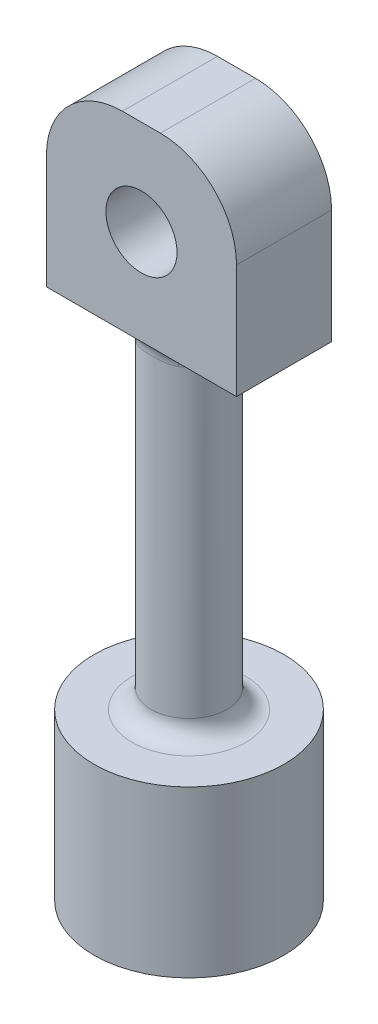
ISO-10303-21;
HEADER;
FILE_DESCRIPTION(('STEP AP214'),'2;1');
FILE_NAME('part.step','',(''),(''),'','','');
FILE_SCHEMA(('AUTOMOTIVE_DESIGN { 1 0 10303 214 1 1 1 1 }'));
ENDSEC;
DATA;
#1=APPLICATION_CONTEXT('core data for automotive mechanical design processes');
#2=APPLICATION_PROTOCOL_DEFINITION('international standard','automotive_design',2000,#1);
#3=PRODUCT_CONTEXT('',#1,'mechanical');
#4=PRODUCT('Part','Part','',(#3));
#5=PRODUCT_RELATED_PRODUCT_CATEGORY('part','',(#4));
#6=PRODUCT_DEFINITION_FORMATION('','',#4);
#7=PRODUCT_DEFINITION_CONTEXT('part definition',#1,'design');
#8=PRODUCT_DEFINITION('design','',#6,#7);
#9=PRODUCT_DEFINITION_SHAPE('','',#8);
#10=(LENGTH_UNIT() NAMED_UNIT(*) SI_UNIT(.MILLI.,.METRE.));
#11=(NAMED_UNIT(*) PLANE_ANGLE_UNIT() SI_UNIT($,.RADIAN.));
#12=(NAMED_UNIT(*) SI_UNIT($,.STERADIAN.) SOLID_ANGLE_UNIT());
#13=UNCERTAINTY_MEASURE_WITH_UNIT(LENGTH_MEASURE(1.E-05),#10,'distance_accuracy_value','');
#14=(GEOMETRIC_REPRESENTATION_CONTEXT(3) GLOBAL_UNCERTAINTY_ASSIGNED_CONTEXT((#13)) GLOBAL_UNIT_ASSIGNED_CONTEXT((#10,
#11,#12)) REPRESENTATION_CONTEXT('',''));
#15=CARTESIAN_POINT('',(0.,0.,0.));
#16=DIRECTION('',(0.,0.,1.));
#17=DIRECTION('',(1.,0.,0.));
#18=AXIS2_PLACEMENT_3D('',#15,#16,#17);
#19=CARTESIAN_POINT('',(-6.35000000000034,37.1852685018555,3.175));
#20=DIRECTION('',(0.,1.,0.));
#21=DIRECTION('',(0.,0.,1.));
#22=AXIS2_PLACEMENT_3D('',#19,#20,#21);
#23=PLANE('',#22);
#24=DIRECTION('',(1.,0.,0.));
#25=VECTOR('',#24,1.);
#26=CARTESIAN_POINT('',(-6.35000000000034,37.1852685018555,-3.175));
#27=LINE('',#26,#25);
#28=CARTESIAN_POINT('',(-6.35000000000034,37.1852685018555,-3.175));
#29=VERTEX_POINT('',#28);
#30=CARTESIAN_POINT('',(-2.10605674187589,37.1852685018552,-3.175));
#31=VERTEX_POINT('',#30);
#32=EDGE_CURVE('E185',#29,#31,#27,.T.);
#33=ORIENTED_EDGE('',*,*,#32,.T.);
#34=CARTESIAN_POINT('',(0.,37.1852685018552,0.));
#35=DIRECTION('',(0.,1.,0.));
#36=DIRECTION('',(0.,0.,1.));
#37=AXIS2_PLACEMENT_3D('',#34,#35,#36);
#38=CIRCLE('',#37,3.81);
#39=CARTESIAN_POINT('',(-2.10605674187589,37.1852685018552,3.175));
#40=VERTEX_POINT('',#39);
#41=EDGE_CURVE('E162',#31,#40,#38,.T.);
#42=ORIENTED_EDGE('',*,*,#41,.T.);
#43=DIRECTION('',(1.,0.,0.));
#44=VECTOR('',#43,1.);
#45=CARTESIAN_POINT('',(-6.35000000000034,37.1852685018555,3.175));
#46=LINE('',#45,#44);
#47=CARTESIAN_POINT('',(-6.35000000000034,37.1852685018555,3.175));
#48=VERTEX_POINT('',#47);
#49=EDGE_CURVE('E139',#48,#40,#46,.T.);
#50=ORIENTED_EDGE('',*,*,#49,.F.);
#51=DIRECTION('',(0.,0.,-1.));
#52=VECTOR('',#51,1.);
#53=CARTESIAN_POINT('',(-6.35000000000034,37.1852685018555,3.175));
#54=LINE('',#53,#52);
#55=EDGE_CURVE('E150',#48,#29,#54,.T.);
#56=ORIENTED_EDGE('',*,*,#55,.T.);
#57=EDGE_LOOP('',(#33,#42,#50,#56));
#58=FACE_BOUND('',#57,.T.);
#59=ADVANCED_FACE('F54',(#58),#23,.F.);
#60=CARTESIAN_POINT('',(6.34999999999999,37.1852685018554,3.175));
#61=DIRECTION('',(-1.,0.,0.));
#62=DIRECTION('',(0.,-1.,0.));
#63=AXIS2_PLACEMENT_3D('',#60,#61,#62);
#64=PLANE('',#63);
#65=DIRECTION('',(0.,1.,0.));
#66=VECTOR('',#65,1.);
#67=CARTESIAN_POINT('',(6.35,37.1852685018552,-3.175));
#68=LINE('',#67,#66);
#69=CARTESIAN_POINT('',(6.35,37.1852685018552,-3.175));
#70=VERTEX_POINT('',#69);
#71=CARTESIAN_POINT('',(6.34999999999999,44.8052685018553,-3.175));
#72=VERTEX_POINT('',#71);
#73=EDGE_CURVE('E198',#70,#72,#68,.T.);
#74=ORIENTED_EDGE('',*,*,#73,.T.);
#75=DIRECTION('',(0.,0.,-1.));
#76=VECTOR('',#75,1.);
#77=CARTESIAN_POINT('',(6.34999999999997,44.8052685018553,3.175));
#78=LINE('',#77,#76);
#79=CARTESIAN_POINT('',(6.34999999999997,44.8052685018553,3.175));
#80=VERTEX_POINT('',#79);
#81=EDGE_CURVE('E13',#72,#80,#78,.F.);
#82=ORIENTED_EDGE('',*,*,#81,.T.);
#83=DIRECTION('',(0.,1.,0.));
#84=VECTOR('',#83,1.);
#85=CARTESIAN_POINT('',(6.34999999999999,37.1852685018554,3.175));
#86=LINE('',#85,#84);
#87=CARTESIAN_POINT('',(6.34999999999999,37.1852685018554,3.175));
#88=VERTEX_POINT('',#87);
#89=EDGE_CURVE('E175',#88,#80,#86,.T.);
#90=ORIENTED_EDGE('',*,*,#89,.F.);
#91=DIRECTION('',(0.,0.,-1.));
#92=VECTOR('',#91,1.);
#93=CARTESIAN_POINT('',(6.34999999999999,37.1852685018554,3.175));
#94=LINE('',#93,#92);
#95=EDGE_CURVE('E159',#88,#70,#94,.T.);
#96=ORIENTED_EDGE('',*,*,#95,.T.);
#97=EDGE_LOOP('',(#74,#82,#90,#96));
#98=FACE_BOUND('',#97,.T.);
#99=ADVANCED_FACE('F183',(#98),#64,.F.);
#100=CARTESIAN_POINT('',(-6.35000000000026,49.8852685018554,3.175));
#101=DIRECTION('',(0.,-1.,0.));
#102=DIRECTION('',(0.,0.,-1.));
#103=AXIS2_PLACEMENT_3D('',#100,#101,#102);
#104=PLANE('',#103);
#105=DIRECTION('',(-1.,0.,0.));
#106=VECTOR('',#105,1.);
#107=CARTESIAN_POINT('',(-6.35000000000026,49.8852685018554,-3.175));
#108=LINE('',#107,#106);
#109=CARTESIAN_POINT('',(1.26999999999993,49.8852685018556,-3.175));
#110=VERTEX_POINT('',#109);
#111=CARTESIAN_POINT('',(-1.27000000000001,49.8852685018552,-3.175));
#112=VERTEX_POINT('',#111);
#113=EDGE_CURVE('E378',#110,#112,#108,.T.);
#114=ORIENTED_EDGE('',*,*,#113,.T.);
#115=DIRECTION('',(0.,0.,-1.));
#116=VECTOR('',#115,1.);
#117=CARTESIAN_POINT('',(-1.27000000000001,49.8852685018552,3.175));
#118=LINE('',#117,#116);
#119=CARTESIAN_POINT('',(-1.27000000000001,49.8852685018552,3.175));
#120=VERTEX_POINT('',#119);
#121=EDGE_CURVE('E76',#112,#120,#118,.F.);
#122=ORIENTED_EDGE('',*,*,#121,.T.);
#123=DIRECTION('',(-1.,0.,0.));
#124=VECTOR('',#123,1.);
#125=CARTESIAN_POINT('',(-6.35000000000026,49.8852685018554,3.175));
#126=LINE('',#125,#124);
#127=CARTESIAN_POINT('',(1.26999999999971,49.8852685018557,3.175));
#128=VERTEX_POINT('',#127);
#129=EDGE_CURVE('E147',#128,#120,#126,.T.);
#130=ORIENTED_EDGE('',*,*,#129,.F.);
#131=DIRECTION('',(0.,0.,-1.));
#132=VECTOR('',#131,1.);
#133=CARTESIAN_POINT('',(1.26999999999971,49.8852685018557,3.175));
#134=LINE('',#133,#132);
#135=EDGE_CURVE('E241',#128,#110,#134,.T.);
#136=ORIENTED_EDGE('',*,*,#135,.T.);
#137=EDGE_LOOP('',(#114,#122,#130,#136));
#138=FACE_BOUND('',#137,.T.);
#139=ADVANCED_FACE('F364',(#138),#104,.F.);
#140=CARTESIAN_POINT('',(-6.35000000000034,37.1852685018555,3.175));
#141=DIRECTION('',(1.,0.,0.));
#142=DIRECTION('',(0.,1.,0.));
#143=AXIS2_PLACEMENT_3D('',#140,#141,#142);
#144=PLANE('',#143);
#145=DIRECTION('',(0.,-1.,0.));
#146=VECTOR('',#145,1.);
#147=CARTESIAN_POINT('',(-6.35000000000034,37.1852685018555,3.175));
#148=LINE('',#147,#146);
#149=CARTESIAN_POINT('',(-6.35000000000017,44.8052685018554,3.175));
#150=VERTEX_POINT('',#149);
#151=EDGE_CURVE('E134',#150,#48,#148,.T.);
#152=ORIENTED_EDGE('',*,*,#151,.F.);
#153=DIRECTION('',(0.,0.,-1.));
#154=VECTOR('',#153,1.);
#155=CARTESIAN_POINT('',(-6.35000000000017,44.8052685018554,3.175));
#156=LINE('',#155,#154);
#157=CARTESIAN_POINT('',(-6.35000000000017,44.8052685018554,-3.175));
#158=VERTEX_POINT('',#157);
#159=EDGE_CURVE('E231',#150,#158,#156,.T.);
#160=ORIENTED_EDGE('',*,*,#159,.T.);
#161=DIRECTION('',(0.,-1.,0.));
#162=VECTOR('',#161,1.);
#163=CARTESIAN_POINT('',(-6.35000000000034,37.1852685018555,-3.175));
#164=LINE('',#163,#162);
#165=EDGE_CURVE('E153',#158,#29,#164,.T.);
#166=ORIENTED_EDGE('',*,*,#165,.T.);
#167=ORIENTED_EDGE('',*,*,#55,.F.);
#168=EDGE_LOOP('',(#152,#160,#166,#167));
#169=FACE_BOUND('',#168,.T.);
#170=ADVANCED_FACE('F151',(#169),#144,.F.);
#171=CARTESIAN_POINT('',(2.10605674187568,37.1852685018552,3.175));
#172=VERTEX_POINT('',#171);
#173=EDGE_CURVE('E146',#172,#88,#46,.T.);
#174=ORIENTED_EDGE('',*,*,#173,.F.);
#175=CARTESIAN_POINT('',(0.,37.1852685018552,0.));
#176=DIRECTION('',(0.,1.,0.));
#177=DIRECTION('',(0.,0.,1.));
#178=AXIS2_PLACEMENT_3D('',#175,#176,#177);
#179=CIRCLE('',#178,3.81);
#180=CARTESIAN_POINT('',(2.10605674187568,37.1852685018552,-3.175));
#181=VERTEX_POINT('',#180);
#182=EDGE_CURVE('E265',#172,#181,#179,.T.);
#183=ORIENTED_EDGE('',*,*,#182,.T.);
#184=EDGE_CURVE('E181',#181,#70,#27,.T.);
#185=ORIENTED_EDGE('',*,*,#184,.T.);
#186=ORIENTED_EDGE('',*,*,#95,.F.);
#187=EDGE_LOOP('',(#174,#183,#185,#186));
#188=FACE_BOUND('',#187,.T.);
#189=ADVANCED_FACE('F179',(#188),#23,.F.);
#190=CARTESIAN_POINT('',(0.,0.,3.175));
#191=DIRECTION('',(0.,0.,-1.));
#192=DIRECTION('',(-1.,0.,0.));
#193=AXIS2_PLACEMENT_3D('',#190,#191,#192);
#194=PLANE('',#193);
#195=CARTESIAN_POINT('',(0.,43.5352685018553,3.175));
#196=DIRECTION('',(0.,0.,1.));
#197=DIRECTION('',(1.,0.,0.));
#198=AXIS2_PLACEMENT_3D('',#195,#196,#197);
#199=CIRCLE('',#198,2.3749);
#200=CARTESIAN_POINT('',(2.37489999999992,43.5352685018553,3.175));
#201=VERTEX_POINT('',#200);
#202=EDGE_CURVE('E204',#201,#201,#199,.T.);
#203=ORIENTED_EDGE('',*,*,#202,.F.);
#204=EDGE_LOOP('',(#203));
#205=FACE_BOUND('',#204,.T.);
#206=ORIENTED_EDGE('',*,*,#129,.T.);
#207=CARTESIAN_POINT('',(-1.27000000000001,44.8052685018552,3.175));
#208=DIRECTION('',(0.,0.,-1.));
#209=DIRECTION('',(-1.,0.,0.));
#210=AXIS2_PLACEMENT_3D('',#207,#208,#209);
#211=CIRCLE('',#210,5.08);
#212=EDGE_CURVE('E63',#120,#150,#211,.F.);
#213=ORIENTED_EDGE('',*,*,#212,.T.);
#214=ORIENTED_EDGE('',*,*,#151,.T.);
#215=ORIENTED_EDGE('',*,*,#49,.T.);
#216=EDGE_CURVE('E164',#40,#172,#46,.T.);
#217=ORIENTED_EDGE('',*,*,#216,.T.);
#218=ORIENTED_EDGE('',*,*,#173,.T.);
#219=ORIENTED_EDGE('',*,*,#89,.T.);
#220=CARTESIAN_POINT('',(1.26999999999997,44.8052685018552,3.175));
#221=DIRECTION('',(0.,0.,-1.));
#222=DIRECTION('',(-1.,0.,0.));
#223=AXIS2_PLACEMENT_3D('',#220,#221,#222);
#224=CIRCLE('',#223,5.08);
#225=EDGE_CURVE('E247',#80,#128,#224,.F.);
#226=ORIENTED_EDGE('',*,*,#225,.T.);
#227=EDGE_LOOP('',(#206,#213,#214,#215,#217,#218,#219,#226));
#228=FACE_BOUND('',#227,.T.);
#229=ADVANCED_FACE('F136',(#205,#228),#194,.F.);
#230=CARTESIAN_POINT('',(0.,0.,-3.175));
#231=DIRECTION('',(0.,0.,-1.));
#232=DIRECTION('',(-1.,0.,0.));
#233=AXIS2_PLACEMENT_3D('',#230,#231,#232);
#234=PLANE('',#233);
#235=CARTESIAN_POINT('',(0.,43.5352685018553,-3.175));
#236=DIRECTION('',(0.,0.,-1.));
#237=DIRECTION('',(-1.,0.,0.));
#238=AXIS2_PLACEMENT_3D('',#235,#236,#237);
#239=CIRCLE('',#238,2.3749);
#240=CARTESIAN_POINT('',(-2.37490000000001,43.5352685018553,-3.175));
#241=VERTEX_POINT('',#240);
#242=EDGE_CURVE('E207',#241,#241,#239,.T.);
#243=ORIENTED_EDGE('',*,*,#242,.F.);
#244=EDGE_LOOP('',(#243));
#245=FACE_BOUND('',#244,.T.);
#246=ORIENTED_EDGE('',*,*,#165,.F.);
#247=CARTESIAN_POINT('',(-1.27,44.8052685018552,-3.175));
#248=DIRECTION('',(0.,0.,-1.));
#249=DIRECTION('',(-1.,0.,0.));
#250=AXIS2_PLACEMENT_3D('',#247,#248,#249);
#251=CIRCLE('',#250,5.08);
#252=EDGE_CURVE('E238',#158,#112,#251,.T.);
#253=ORIENTED_EDGE('',*,*,#252,.T.);
#254=ORIENTED_EDGE('',*,*,#113,.F.);
#255=CARTESIAN_POINT('',(1.26999999999997,44.8052685018552,-3.175));
#256=DIRECTION('',(0.,0.,-1.));
#257=DIRECTION('',(-1.,0.,0.));
#258=AXIS2_PLACEMENT_3D('',#255,#256,#257);
#259=CIRCLE('',#258,5.08);
#260=EDGE_CURVE('E234',#110,#72,#259,.T.);
#261=ORIENTED_EDGE('',*,*,#260,.T.);
#262=ORIENTED_EDGE('',*,*,#73,.F.);
#263=ORIENTED_EDGE('',*,*,#184,.F.);
#264=EDGE_CURVE('E191',#31,#181,#27,.T.);
#265=ORIENTED_EDGE('',*,*,#264,.F.);
#266=ORIENTED_EDGE('',*,*,#32,.F.);
#267=EDGE_LOOP('',(#246,#253,#254,#261,#262,#263,#265,#266));
#268=FACE_BOUND('',#267,.T.);
#269=ADVANCED_FACE('F370',(#245,#268),#234,.T.);
#270=CARTESIAN_POINT('',(-1.04083408558608E-13,14.3252685018556,0.));
#271=DIRECTION('',(0.,1.,0.));
#272=DIRECTION('',(0.,0.,1.));
#273=AXIS2_PLACEMENT_3D('',#270,#271,#272);
#274=CYLINDRICAL_SURFACE('',#273,2.54);
#275=CARTESIAN_POINT('',(0.,35.9152685018554,0.));
#276=DIRECTION('',(0.,1.,0.));
#277=DIRECTION('',(0.,0.,1.));
#278=AXIS2_PLACEMENT_3D('',#275,#276,#277);
#279=CIRCLE('',#278,2.54);
#280=CARTESIAN_POINT('',(-1.40403782791714,35.9152685018552,2.11666666666667));
#281=VERTEX_POINT('',#280);
#282=CARTESIAN_POINT('',(-1.40403782791712,35.9152685018552,-2.11666666666667));
#283=VERTEX_POINT('',#282);
#284=EDGE_CURVE('E282',#281,#283,#279,.F.);
#285=ORIENTED_EDGE('',*,*,#284,.T.);
#286=CARTESIAN_POINT('',(-1.83831564022119,36.0385558372143,-1.7527679843375));
#287=CARTESIAN_POINT('',(-1.45075360666117,37.6687788223831,-2.15924582636545));
#288=CARTESIAN_POINT('',(-2.75747346033171,37.1852685018555,-3.175));
#289=CARTESIAN_POINT('',(-1.81430531803405,36.0205746114663,-1.77796123271913));
#290=CARTESIAN_POINT('',(-1.46194495342363,37.6389789356299,-2.13645713806084));
#291=CARTESIAN_POINT('',(-2.72145797705883,37.1852685018555,-3.175));
#292=CARTESIAN_POINT('',(-1.78941948251901,36.0049686037231,-1.80301384779418));
#293=CARTESIAN_POINT('',(-1.47073248027841,37.6069317569519,-2.1184031263596));
#294=CARTESIAN_POINT('',(-2.68412922378732,37.1852685018555,-3.175));
#295=CARTESIAN_POINT('',(-1.73814142009755,35.9780264666644,-1.85249078486691));
#296=CARTESIAN_POINT('',(-1.48263257214984,37.5414449863309,-2.09138260314044));
#297=CARTESIAN_POINT('',(-2.60721213015228,37.1852685018555,-3.175));
#298=CARTESIAN_POINT('',(-1.71175226027169,35.9666819786211,-1.8769162483357));
#299=CARTESIAN_POINT('',(-1.48588018624457,37.5080712944905,-2.08220364788547));
#300=CARTESIAN_POINT('',(-2.5676283904096,37.1852685018555,-3.175));
#301=CARTESIAN_POINT('',(-1.63116240609467,35.938447466093,-1.94833753668748));
#302=CARTESIAN_POINT('',(-1.48674334836601,37.4108782571573,-2.06657196841836));
#303=CARTESIAN_POINT('',(-2.44674360913778,37.1852685018555,-3.175));
#304=CARTESIAN_POINT('',(-1.57498606142168,35.9269729935142,-1.99406237736213));
#305=CARTESIAN_POINT('',(-1.47653785253474,37.3469663388348,-2.07020606843895));
#306=CARTESIAN_POINT('',(-2.36247909213111,37.1852685018555,-3.175));
#307=CARTESIAN_POINT('',(-1.42738025532211,35.91143868786,-2.10395038816793));
#308=CARTESIAN_POINT('',(-1.42414088680291,37.2020244992373,-2.10221098403038));
#309=CARTESIAN_POINT('',(-2.14107038298511,37.1852685018555,-3.175));
#310=CARTESIAN_POINT('',(-1.33321998101196,35.9146698662165,-2.16482858767718));
#311=CARTESIAN_POINT('',(-1.36923366618585,37.1259187490369,-2.14127021575294));
#312=CARTESIAN_POINT('',(-1.9998299715184,37.1852685018555,-3.175));
#313=CARTESIAN_POINT('',(-1.13778049911948,35.9345854611227,-2.27370249296663));
#314=CARTESIAN_POINT('',(-1.22391730797745,37.0064034716762,-2.22907432847527));
#315=CARTESIAN_POINT('',(-1.70667074867865,37.1852685018555,-3.175));
#316=CARTESIAN_POINT('',(-1.03645697655788,35.9513618083325,-2.32160717117295));
#317=CARTESIAN_POINT('',(-1.13434514523392,36.9609345947526,-2.27783580065135));
#318=CARTESIAN_POINT('',(-1.5546854648367,37.1852685018555,-3.175));
#319=CARTESIAN_POINT('',(-0.821971459202822,35.9899041507952,-2.40625619806119));
#320=CARTESIAN_POINT('',(-0.926866541861946,36.8918273816314,-2.37010033517937));
#321=CARTESIAN_POINT('',(-1.23295718880424,37.1852685018555,-3.175));
#322=CARTESIAN_POINT('',(-0.708466913326522,36.0119209920771,-2.44208870148718));
#323=CARTESIAN_POINT('',(-0.80686411049026,36.8681872468746,-2.41413776676253));
#324=CARTESIAN_POINT('',(-1.06270036998941,37.1852685018555,-3.175));
#325=CARTESIAN_POINT('',(-0.535233742181322,36.0405646658397,-2.48367535672256));
#326=CARTESIAN_POINT('',(-0.615600478159503,36.8443774942744,-2.4665016806062));
#327=CARTESIAN_POINT('',(-0.80285061327209,37.1852685018555,-3.175));
#328=CARTESIAN_POINT('',(-0.477066864094636,36.0493741155371,-2.4955034331806));
#329=CARTESIAN_POINT('',(-0.550403207057688,36.838337024612,-2.48168354496011));
#330=CARTESIAN_POINT('',(-0.715600296142392,37.1852685018555,-3.175));
#331=CARTESIAN_POINT('',(-0.359915564561437,36.0645359523566,-2.51507142565873));
#332=CARTESIAN_POINT('',(-0.417599545586233,36.8289873359652,-2.50699110839662));
#333=CARTESIAN_POINT('',(-0.539873346842593,37.1852685018555,-3.175));
#334=CARTESIAN_POINT('',(-0.300931436877466,36.0708891997905,-2.52281277344815));
#335=CARTESIAN_POINT('',(-0.349770975763604,36.8256353988626,-2.51721062537906));
#336=CARTESIAN_POINT('',(-0.451397155316305,37.1852685018555,-3.175));
#337=CARTESIAN_POINT('',(-0.171755880248496,36.081193452043,-2.53515927163515));
#338=CARTESIAN_POINT('',(-0.200522190156612,36.82049080808,-2.53350557205261));
#339=CARTESIAN_POINT('',(-0.257633820372507,37.1852685018555,-3.175));
#340=CARTESIAN_POINT('',(-0.101461028597479,36.0845048974245,-2.53894743153238));
#341=CARTESIAN_POINT('',(-0.118388680709021,36.819056627054,-2.53859571542162));
#342=CARTESIAN_POINT('',(-0.152191542896038,37.1852685018555,-3.175));
#343=CARTESIAN_POINT('',(0.0392292984342057,36.0859975558784,-2.54067137423043));
#344=CARTESIAN_POINT('',(0.0457236454247501,36.8183926194531,-2.54089515488795));
#345=CARTESIAN_POINT('',(0.0588439476512314,37.1852685018555,-3.175));
#346=CARTESIAN_POINT('',(0.109624781936434,36.0841783284321,-2.53860665450393));
#347=CARTESIAN_POINT('',(0.128144441372171,36.8191594476282,-2.53811621016374));
#348=CARTESIAN_POINT('',(0.164437172904372,37.1852685018555,-3.175));
#349=CARTESIAN_POINT('',(0.250089625255925,36.0757212083924,-2.52864167150419));
#350=CARTESIAN_POINT('',(0.291191200794365,36.823171567613,-2.52489593997201));
#351=CARTESIAN_POINT('',(0.375134437884271,37.1852685018555,-3.175));
#352=CARTESIAN_POINT('',(0.32015726814551,36.0690682104624,-2.52072311386588));
#353=CARTESIAN_POINT('',(0.372241171557304,36.8264469403447,-2.51435942355358));
#354=CARTESIAN_POINT('',(0.480235902219518,37.1852685018555,-3.175));
#355=CARTESIAN_POINT('',(0.459181574423739,36.0520949525189,-2.49914052659051));
#356=CARTESIAN_POINT('',(0.530475009564606,36.8365022224479,-2.48633248453244));
#357=CARTESIAN_POINT('',(0.688772361635545,37.1852685018555,-3.175));
#358=CARTESIAN_POINT('',(0.528138169110176,36.0417744666273,-2.48547614306245));
#359=CARTESIAN_POINT('',(0.608039298474663,36.8433444137792,-2.468697060834));
#360=CARTESIAN_POINT('',(0.792207253663016,37.1852685018555,-3.175));
#361=CARTESIAN_POINT('',(0.720680318186104,36.0098330486999,-2.43897203089036));
#362=CARTESIAN_POINT('',(0.82042862813327,36.8700525247113,-2.41018525109082));
#363=CARTESIAN_POINT('',(1.08102047728341,37.1852685018555,-3.175));
#364=CARTESIAN_POINT('',(0.842559132546354,35.9858983586475,-2.39960403191936));
#365=CARTESIAN_POINT('',(0.948845354349185,36.8963335316827,-2.36181615097926));
#366=CARTESIAN_POINT('',(1.26383869884288,37.1852685018555,-3.175));
#367=CARTESIAN_POINT('',(1.07891282266111,35.9441166827247,-2.30298527347527));
#368=CARTESIAN_POINT('',(1.17397398571182,36.9778340968943,-2.25823492815114));
#369=CARTESIAN_POINT('',(1.61836923396854,37.1852685018555,-3.175));
#370=CARTESIAN_POINT('',(1.19342166879705,35.9262398589144,-2.24582490508659));
#371=CARTESIAN_POINT('',(1.27118984233523,37.0349812844119,-2.20186556768396));
#372=CARTESIAN_POINT('',(1.79013250310727,37.1852685018555,-3.175));
#373=CARTESIAN_POINT('',(1.37107614737568,35.9142793978298,-2.13962315517976));
#374=CARTESIAN_POINT('',(1.38914589027983,37.1565936573333,-2.1271770230652));
#375=CARTESIAN_POINT('',(2.0566142211182,37.1852685018555,-3.175));
#376=CARTESIAN_POINT('',(1.43712221399037,35.9137124161373,-2.0958319407445));
#377=CARTESIAN_POINT('',(1.42513559033845,37.2118898660534,-2.10219868982998));
#378=CARTESIAN_POINT('',(2.15568332115341,37.1852685018555,-3.175));
#379=CARTESIAN_POINT('',(1.53291689806259,35.9221296301298,-2.02567263231359));
#380=CARTESIAN_POINT('',(1.46182244061609,37.3037615837961,-2.07900024101458));
#381=CARTESIAN_POINT('',(2.29937534719867,37.1852685018555,-3.175));
#382=CARTESIAN_POINT('',(1.56441408186902,35.9265139055347,-2.0014418674587));
#383=CARTESIAN_POINT('',(1.47119060673988,37.3366822307341,-2.07367961547335));
#384=CARTESIAN_POINT('',(2.34662112284781,37.1852685018555,-3.175));
#385=CARTESIAN_POINT('',(1.62608753999984,35.9390436996952,-1.95167075755931));
#386=CARTESIAN_POINT('',(1.48366955631206,37.4049477522921,-2.06969009583306));
#387=CARTESIAN_POINT('',(2.43913130996252,37.1852685018555,-3.175));
#388=CARTESIAN_POINT('',(1.65626164997887,35.9471951467848,-1.92612840501467));
#389=CARTESIAN_POINT('',(1.48661398449217,37.4403598840763,-2.07119839725305));
#390=CARTESIAN_POINT('',(2.4843924749101,37.1852685018555,-3.175));
#391=CARTESIAN_POINT('',(1.68565829798953,35.9575409065133,-1.90004107913978));
#392=CARTESIAN_POINT('',(1.4861648033268,37.4758655567636,-2.07702560245627));
#393=CARTESIAN_POINT('',(2.52848744698438,37.1852685018555,-3.175));
#394=(BOUNDED_SURFACE() B_SPLINE_SURFACE(3,2,((#286,#287,#288),(#289,#290,#291),(#292,#293,
#294),(#295,#296,#297),(#298,#299,#300),(#301,#302,#303),(#304,#305,#306),(#307,#308,#309),
(#310,#311,#312),(#313,#314,#315),(#316,#317,#318),(#319,#320,#321),(#322,#323,#324),(#325,#326,
#327),(#328,#329,#330),(#331,#332,#333),(#334,#335,#336),(#337,#338,#339),(#340,#341,#342),
(#343,#344,#345),(#346,#347,#348),(#349,#350,#351),(#352,#353,#354),(#355,#356,#357),(#358,#359,
#360),(#361,#362,#363),(#364,#365,#366),(#367,#368,#369),(#370,#371,#372),(#373,#374,#375),
(#376,#377,#378),(#379,#380,#381),(#382,#383,#384),(#385,#386,#387),(#388,#389,#390),(#391,#392,
#393)),.UNSPECIFIED.,.F.,.F.,.F.) B_SPLINE_SURFACE_WITH_KNOTS((4,2,2,2,2,2,2,2,2,2,2,2,2,2,2,2,
2,4),(3,3),(0.,0.165478964280856,0.330631634870768,0.657187123329515,1.15911064900214,
1.66446964051089,2.20221153747686,2.47042166305056,2.73853775979551,3.05498965599525,
3.37146872352754,3.68894105243304,4.00643293763199,4.58500515335889,5.16068472701102,
5.51628394310174,5.69542592105599,5.87485077670774),(0.,1.),
.UNSPECIFIED.) GEOMETRIC_REPRESENTATION_ITEM() RATIONAL_B_SPLINE_SURFACE(((1.,0.593046572981383,
1.),(1.,0.599903529057062,1.),(1.,0.606980350720264,1.),(1.,0.621392399509871,1.),(1.,
0.628727089593808,1.),(1.,0.650721583165682,1.),(1.,0.665534782996803,1.),(1.,0.702309478093337,
1.),(1.,0.723837732724256,1.),(1.,0.763359635592708,1.),(1.,0.781328082295274,1.),(1.,
0.813539291789726,1.),(1.,0.827469535836319,1.),(1.,0.843752235078246,1.),(1.,0.84840811175397,
1.),(1.,0.856131724328274,1.),(1.,0.859200016423374,1.),(1.,0.864098930789843,1.),(1.,
0.865606705247392,1.),(1.,0.866292473729698,1.),(1.,0.865470267702702,1.),(1.,0.861511666313441,
1.),(1.,0.85836801602651,1.),(1.,0.84984032833941,1.),(1.,0.844456152943337,1.),(1.,
0.826251623547128,1.),(1.,0.810957187187134,1.),(1.,0.77430715785141,1.),(1.,0.752982250667478,
1.),(1.,0.715018996161014,1.),(1.,0.699705643124629,1.),(1.,0.676076182482063,1.),(1.,
0.668058615733593,1.),(1.,0.651959945216795,1.),(1.,0.64387876111057,1.),(1.,0.63584855614169,1.))) REPRESENTATION_ITEM('') SURFACE());
#395=CARTESIAN_POINT('',(-1.83831564022119,36.0385558372143,-1.7527679843375));
#396=CARTESIAN_POINT('',(-1.81430531803405,36.0205746114663,-1.77796123271913));
#397=CARTESIAN_POINT('',(-1.78941948251901,36.0049686037231,-1.80301384779418));
#398=CARTESIAN_POINT('',(-1.73814142009755,35.9780264666644,-1.85249078486691));
#399=CARTESIAN_POINT('',(-1.71175226027169,35.9666819786211,-1.8769162483357));
#400=CARTESIAN_POINT('',(-1.63116240609467,35.9384474660931,-1.94833753668748));
#401=CARTESIAN_POINT('',(-1.57498606142168,35.9269729935142,-1.99406237736213));
#402=CARTESIAN_POINT('',(-1.42738025532211,35.91143868786,-2.10395038816793));
#403=CARTESIAN_POINT('',(-1.33321998101196,35.9146698662165,-2.16482858767718));
#404=CARTESIAN_POINT('',(-1.13778049911948,35.9345854611227,-2.27370249296663));
#405=CARTESIAN_POINT('',(-1.03645697655788,35.9513618083325,-2.32160717117295));
#406=CARTESIAN_POINT('',(-0.821971459202822,35.9899041507952,-2.40625619806119));
#407=CARTESIAN_POINT('',(-0.708466913326522,36.0119209920771,-2.44208870148718));
#408=CARTESIAN_POINT('',(-0.535233742181322,36.0405646658397,-2.48367535672256));
#409=CARTESIAN_POINT('',(-0.477066864094636,36.0493741155371,-2.4955034331806));
#410=CARTESIAN_POINT('',(-0.359915564561437,36.0645359523566,-2.51507142565873));
#411=CARTESIAN_POINT('',(-0.300931436877466,36.0708891997905,-2.52281277344815));
#412=CARTESIAN_POINT('',(-0.171755880248496,36.081193452043,-2.53515927163515));
#413=CARTESIAN_POINT('',(-0.101461028597479,36.0845048974245,-2.53894743153238));
#414=CARTESIAN_POINT('',(0.0392292984342057,36.0859975558784,-2.54067137423043));
#415=CARTESIAN_POINT('',(0.109624781936434,36.0841783284321,-2.53860665450393));
#416=CARTESIAN_POINT('',(0.250089625255925,36.0757212083924,-2.52864167150419));
#417=CARTESIAN_POINT('',(0.32015726814551,36.0690682104624,-2.52072311386588));
#418=CARTESIAN_POINT('',(0.459181574423739,36.0520949525189,-2.49914052659051));
#419=CARTESIAN_POINT('',(0.528138169110176,36.0417744666273,-2.48547614306245));
#420=CARTESIAN_POINT('',(0.720680318186104,36.0098330486999,-2.43897203089036));
#421=CARTESIAN_POINT('',(0.842559132546354,35.9858983586475,-2.39960403191936));
#422=CARTESIAN_POINT('',(1.07891282266111,35.9441166827247,-2.30298527347527));
#423=CARTESIAN_POINT('',(1.19342166879705,35.9262398589144,-2.24582490508659));
#424=CARTESIAN_POINT('',(1.37107614737568,35.9142793978298,-2.13962315517976));
#425=CARTESIAN_POINT('',(1.43712221399037,35.9137124161373,-2.0958319407445));
#426=CARTESIAN_POINT('',(1.53291689806259,35.9221296301298,-2.02567263231359));
#427=CARTESIAN_POINT('',(1.56441408186902,35.9265139055347,-2.0014418674587));
#428=CARTESIAN_POINT('',(1.62608753999984,35.9390436996952,-1.95167075755931));
#429=CARTESIAN_POINT('',(1.65626164997887,35.9471951467848,-1.92612840501467));
#430=CARTESIAN_POINT('',(1.68565829798953,35.9575409065133,-1.90004107913978));
#431=B_SPLINE_CURVE_WITH_KNOTS('',3,(#395,#396,#397,#398,#399,#400,#401,#402,#403,#404,#405,
#406,#407,#408,#409,#410,#411,#412,#413,#414,#415,#416,#417,#418,#419,#420,#421,#422,#423,#424,
#425,#426,#427,#428,#429,#430),.UNSPECIFIED.,.F.,.F.,(4,2,2,2,2,2,2,2,2,2,2,2,2,2,2,2,2,4),(0.,
0.165478964280856,0.330631634870768,0.657187123329515,1.15911064900214,1.66446964051089,
2.20221153747686,2.47042166305056,2.73853775979551,3.05498965599525,3.37146872352754,
3.68894105243304,4.00643293763199,4.58500515335889,5.16068472701102,5.51628394310174,
5.69542592105599,5.87485077670774),.UNSPECIFIED.);
#432=CARTESIAN_POINT('',(1.40403782791712,35.9152685018552,-2.11666666666667));
#433=VERTEX_POINT('',#432);
#434=EDGE_CURVE('E269',#283,#433,#431,.T.);
#435=ORIENTED_EDGE('',*,*,#434,.T.);
#436=CARTESIAN_POINT('',(0.,35.9152685018554,0.));
#437=DIRECTION('',(0.,1.,0.));
#438=DIRECTION('',(0.,0.,1.));
#439=AXIS2_PLACEMENT_3D('',#436,#437,#438);
#440=CIRCLE('',#439,2.54);
#441=CARTESIAN_POINT('',(1.40403782791712,35.9152685018552,2.11666666666667));
#442=VERTEX_POINT('',#441);
#443=EDGE_CURVE('E274',#433,#442,#440,.F.);
#444=ORIENTED_EDGE('',*,*,#443,.T.);
#445=CARTESIAN_POINT('',(1.83831564022102,36.0385558372143,1.75276798433746));
#446=CARTESIAN_POINT('',(1.45075360666105,37.6687788223831,2.15924582636548));
#447=CARTESIAN_POINT('',(2.75747346033161,37.1852685018555,3.175));
#448=CARTESIAN_POINT('',(1.81430531803388,36.0205746114663,1.7779612327191));
#449=CARTESIAN_POINT('',(1.46194495342345,37.6389789356299,2.13645713806088));
#450=CARTESIAN_POINT('',(2.72145797705871,37.1852685018555,3.175));
#451=CARTESIAN_POINT('',(1.78941948251884,36.0049686037231,1.80301384779414));
#452=CARTESIAN_POINT('',(1.47073248027821,37.6069317569519,2.11840312635963));
#453=CARTESIAN_POINT('',(2.68412922378718,37.1852685018555,3.175));
#454=CARTESIAN_POINT('',(1.73814142009739,35.9780264666645,1.85249078486686));
#455=CARTESIAN_POINT('',(1.48263257214961,37.5414449863309,2.09138260314045));
#456=CARTESIAN_POINT('',(2.60721213015213,37.1852685018555,3.175));
#457=CARTESIAN_POINT('',(1.71175226027153,35.9666819786212,1.87691624833565));
#458=CARTESIAN_POINT('',(1.48588018624435,37.5080712944905,2.08220364788548));
#459=CARTESIAN_POINT('',(2.56762839040945,37.1852685018555,3.175));
#460=CARTESIAN_POINT('',(1.63116240609453,35.9384474660931,1.94833753668743));
#461=CARTESIAN_POINT('',(1.48674334836583,37.4108782571573,2.06657196841837));
#462=CARTESIAN_POINT('',(2.44674360913769,37.1852685018555,3.175));
#463=CARTESIAN_POINT('',(1.57498606142155,35.9269729935142,1.99406237736207));
#464=CARTESIAN_POINT('',(1.47653785253467,37.3469663388348,2.07020606843899));
#465=CARTESIAN_POINT('',(2.36247909213108,37.1852685018555,3.175));
#466=CARTESIAN_POINT('',(1.42738025532198,35.91143868786,2.10395038816788));
#467=CARTESIAN_POINT('',(1.4241408868029,37.2020244992372,2.10221098403042));
#468=CARTESIAN_POINT('',(2.14107038298511,37.1852685018555,3.175));
#469=CARTESIAN_POINT('',(1.33321998101181,35.9146698662164,2.16482858767714));
#470=CARTESIAN_POINT('',(1.36923366618572,37.1259187490368,2.14127021575293));
#471=CARTESIAN_POINT('',(1.99982997151831,37.1852685018555,3.175));
#472=CARTESIAN_POINT('',(1.13778049911931,35.9345854611228,2.27370249296661));
#473=CARTESIAN_POINT('',(1.22391730797724,37.0064034716763,2.22907432847523));
#474=CARTESIAN_POINT('',(1.70667074867847,37.1852685018555,3.175));
#475=CARTESIAN_POINT('',(1.0364569765577,35.9513618083327,2.32160717117294));
#476=CARTESIAN_POINT('',(1.13434514523375,36.9609345947529,2.27783580065133));
#477=CARTESIAN_POINT('',(1.55468546483653,37.1852685018555,3.175));
#478=CARTESIAN_POINT('',(0.821971459202639,35.9899041507954,2.40625619806118));
#479=CARTESIAN_POINT('',(0.926866541861792,36.8918273816316,2.37010033517936));
#480=CARTESIAN_POINT('',(1.23295718880408,37.1852685018555,3.175));
#481=CARTESIAN_POINT('',(0.708466913326347,36.0119209920772,2.44208870148717));
#482=CARTESIAN_POINT('',(0.806864110490092,36.8681872468746,2.41413776676252));
#483=CARTESIAN_POINT('',(1.06270036998926,37.1852685018555,3.175));
#484=CARTESIAN_POINT('',(0.53523374218118,36.0405646658397,2.48367535672254));
#485=CARTESIAN_POINT('',(0.615600478159364,36.8443774942744,2.46650168060618));
#486=CARTESIAN_POINT('',(0.802850613271979,37.1852685018555,3.175));
#487=CARTESIAN_POINT('',(0.477066864094509,36.0493741155371,2.49550343318058));
#488=CARTESIAN_POINT('',(0.550403207057569,36.838337024612,2.48168354496008));
#489=CARTESIAN_POINT('',(0.715600296142304,37.1852685018555,3.175));
#490=CARTESIAN_POINT('',(0.359915564561338,36.0645359523566,2.51507142565872));
#491=CARTESIAN_POINT('',(0.417599545586151,36.8289873359652,2.50699110839661));
#492=CARTESIAN_POINT('',(0.539873346842549,37.1852685018555,3.175));
#493=CARTESIAN_POINT('',(0.300931436877381,36.0708891997904,2.52281277344813));
#494=CARTESIAN_POINT('',(0.34977097576354,36.8256353988626,2.51721062537906));
#495=CARTESIAN_POINT('',(0.451397155316284,37.1852685018555,3.175));
#496=CARTESIAN_POINT('',(0.171755880248423,36.081193452043,2.53515927163514));
#497=CARTESIAN_POINT('',(0.200522190156564,36.82049080808,2.53350557205262));
#498=CARTESIAN_POINT('',(0.257633820372504,37.1852685018555,3.175));
#499=CARTESIAN_POINT('',(0.101461028597404,36.0845048974245,2.53894743153237));
#500=CARTESIAN_POINT('',(0.118388680708969,36.819056627054,2.53859571542162));
#501=CARTESIAN_POINT('',(0.15219154289603,37.1852685018555,3.175));
#502=CARTESIAN_POINT('',(-0.0392292984342848,36.0859975558784,2.54067137423043));
#503=CARTESIAN_POINT('',(-0.045723645424808,36.8183926194531,2.54089515488794));
#504=CARTESIAN_POINT('',(-0.0588439476512464,37.1852685018555,3.175));
#505=CARTESIAN_POINT('',(-0.109624781936516,36.0841783284321,2.53860665450393));
#506=CARTESIAN_POINT('',(-0.128144441372231,36.8191594476282,2.53811621016374));
#507=CARTESIAN_POINT('',(-0.16443717290439,37.1852685018555,3.175));
#508=CARTESIAN_POINT('',(-0.250089625256013,36.0757212083925,2.5286416715042));
#509=CARTESIAN_POINT('',(-0.291191200794436,36.823171567613,2.52489593997203));
#510=CARTESIAN_POINT('',(-0.3751344378843,37.1852685018555,3.175));
#511=CARTESIAN_POINT('',(-0.320157268145603,36.0690682104624,2.5207231138659));
#512=CARTESIAN_POINT('',(-0.372241171557384,36.8264469403447,2.51435942355361));
#513=CARTESIAN_POINT('',(-0.480235902219554,37.1852685018555,3.175));
#514=CARTESIAN_POINT('',(-0.459181574423837,36.0520949525189,2.49914052659053));
#515=CARTESIAN_POINT('',(-0.530475009564685,36.8365022224479,2.48633248453245));
#516=CARTESIAN_POINT('',(-0.688772361635585,37.1852685018555,3.175));
#517=CARTESIAN_POINT('',(-0.528138169110275,36.0417744666273,2.48547614306247));
#518=CARTESIAN_POINT('',(-0.608039298474734,36.8433444137792,2.468697060834));
#519=CARTESIAN_POINT('',(-0.792207253663053,37.1852685018555,3.175));
#520=CARTESIAN_POINT('',(-0.720680318186215,36.0098330486998,2.43897203089038));
#521=CARTESIAN_POINT('',(-0.82042862813336,36.8700525247112,2.41018525109081));
#522=CARTESIAN_POINT('',(-1.08102047728346,37.1852685018555,3.175));
#523=CARTESIAN_POINT('',(-0.84255913254648,35.9858983586476,2.39960403191939));
#524=CARTESIAN_POINT('',(-0.948845354349328,36.8963335316827,2.36181615097929));
#525=CARTESIAN_POINT('',(-1.26383869884298,37.1852685018555,3.175));
#526=CARTESIAN_POINT('',(-1.07891282266125,35.9441166827247,2.30298527347531));
#527=CARTESIAN_POINT('',(-1.17397398571195,36.9778340968942,2.25823492815118));
#528=CARTESIAN_POINT('',(-1.61836923396863,37.1852685018555,3.175));
#529=CARTESIAN_POINT('',(-1.19342166879718,35.9262398589141,2.24582490508663));
#530=CARTESIAN_POINT('',(-1.2711898423353,37.0349812844117,2.20186556768394));
#531=CARTESIAN_POINT('',(-1.79013250310733,37.1852685018555,3.175));
#532=CARTESIAN_POINT('',(-1.37107614737582,35.9142793978296,2.1396231551798));
#533=CARTESIAN_POINT('',(-1.38914589027994,37.1565936573331,2.12717702306518));
#534=CARTESIAN_POINT('',(-2.05661422111826,37.1852685018555,3.175));
#535=CARTESIAN_POINT('',(-1.43712221399051,35.9137124161373,2.09583194074455));
#536=CARTESIAN_POINT('',(-1.4251355903386,37.2118898660533,2.10219868983));
#537=CARTESIAN_POINT('',(-2.1556833211535,37.1852685018555,3.175));
#538=CARTESIAN_POINT('',(-1.53291689806273,35.9221296301298,2.02567263231364));
#539=CARTESIAN_POINT('',(-1.46182244061629,37.3037615837961,2.0790002410146));
#540=CARTESIAN_POINT('',(-2.29937534719878,37.1852685018555,3.175));
#541=CARTESIAN_POINT('',(-1.56441408186916,35.9265139055347,2.00144186745876));
#542=CARTESIAN_POINT('',(-1.47119060674008,37.3366822307341,2.07367961547337));
#543=CARTESIAN_POINT('',(-2.34662112284792,37.1852685018555,3.175));
#544=CARTESIAN_POINT('',(-1.62608753999998,35.9390436996952,1.95167075755936));
#545=CARTESIAN_POINT('',(-1.48366955631225,37.404947752292,2.06969009583305));
#546=CARTESIAN_POINT('',(-2.43913130996262,37.1852685018555,3.175));
#547=CARTESIAN_POINT('',(-1.65626164997901,35.9471951467848,1.92612840501473));
#548=CARTESIAN_POINT('',(-1.48661398449233,37.4403598840762,2.07119839725302));
#549=CARTESIAN_POINT('',(-2.48439247491018,37.1852685018555,3.175));
#550=CARTESIAN_POINT('',(-1.68565829798968,35.9575409065131,1.90004107913984));
#551=CARTESIAN_POINT('',(-1.4861648033269,37.4758655567634,2.07702560245621));
#552=CARTESIAN_POINT('',(-2.52848744698442,37.1852685018555,3.175));
#553=(BOUNDED_SURFACE() B_SPLINE_SURFACE(3,2,((#445,#446,#447),(#448,#449,#450),(#451,#452,
#453),(#454,#455,#456),(#457,#458,#459),(#460,#461,#462),(#463,#464,#465),(#466,#467,#468),
(#469,#470,#471),(#472,#473,#474),(#475,#476,#477),(#478,#479,#480),(#481,#482,#483),(#484,#485,
#486),(#487,#488,#489),(#490,#491,#492),(#493,#494,#495),(#496,#497,#498),(#499,#500,#501),
(#502,#503,#504),(#505,#506,#507),(#508,#509,#510),(#511,#512,#513),(#514,#515,#516),(#517,#518,
#519),(#520,#521,#522),(#523,#524,#525),(#526,#527,#528),(#529,#530,#531),(#532,#533,#534),
(#535,#536,#537),(#538,#539,#540),(#541,#542,#543),(#544,#545,#546),(#547,#548,#549),(#550,#551,
#552)),.UNSPECIFIED.,.F.,.F.,.F.) B_SPLINE_SURFACE_WITH_KNOTS((4,2,2,2,2,2,2,2,2,2,2,2,2,2,2,2,
2,4),(3,3),(0.,0.16547896428084,0.33063163487074,0.657187123329428,1.15911064900214,
1.664469640511,2.20221153747685,2.4704216630505,2.73853775979539,3.05498965599514,
3.37146872352744,3.68894105243295,4.00643293763192,4.58500515335885,5.16068472701099,
5.5162839431017,5.69542592105595,5.87485077670769),(0.,1.),
.UNSPECIFIED.) GEOMETRIC_REPRESENTATION_ITEM() RATIONAL_B_SPLINE_SURFACE(((1.,0.593046572981384,
1.),(1.,0.599903529057058,1.),(1.,0.606980350720255,1.),(1.,0.621392399509856,1.),(1.,
0.628727089593792,1.),(1.,0.65072158316567,1.),(1.,0.665534782996804,1.),(1.,0.702309478093346,
1.),(1.,0.723837732724245,1.),(1.,0.763359635592699,1.),(1.,0.781328082295286,1.),(1.,
0.813539291789743,1.),(1.,0.827469535836318,1.),(1.,0.843752235078238,1.),(1.,0.848408111753962,
1.),(1.,0.856131724328269,1.),(1.,0.859200016423371,1.),(1.,0.864098930789842,1.),(1.,
0.865606705247391,1.),(1.,0.866292473729698,1.),(1.,0.865470267702703,1.),(1.,0.861511666313446,
1.),(1.,0.858368016026518,1.),(1.,0.849840328339414,1.),(1.,0.844456152943335,1.),(1.,
0.826251623547123,1.),(1.,0.810957187187147,1.),(1.,0.774307157851421,1.),(1.,0.75298225066747,
1.),(1.,0.715018996161014,1.),(1.,0.699705643124643,1.),(1.,0.676076182482083,1.),(1.,
0.668058615733613,1.),(1.,0.651959945216811,1.),(1.,0.643878761110582,1.),(1.,0.635848556141695,1.))) REPRESENTATION_ITEM('') SURFACE());
#554=CARTESIAN_POINT('',(1.83831564022102,36.0385558372143,1.75276798433746));
#555=CARTESIAN_POINT('',(1.81430531803388,36.0205746114663,1.7779612327191));
#556=CARTESIAN_POINT('',(1.78941948251884,36.0049686037231,1.80301384779414));
#557=CARTESIAN_POINT('',(1.73814142009739,35.9780264666645,1.85249078486686));
#558=CARTESIAN_POINT('',(1.71175226027153,35.9666819786212,1.87691624833565));
#559=CARTESIAN_POINT('',(1.63116240609453,35.9384474660931,1.94833753668743));
#560=CARTESIAN_POINT('',(1.57498606142155,35.9269729935142,1.99406237736207));
#561=CARTESIAN_POINT('',(1.42738025532198,35.91143868786,2.10395038816788));
#562=CARTESIAN_POINT('',(1.33321998101181,35.9146698662164,2.16482858767714));
#563=CARTESIAN_POINT('',(1.13778049911931,35.9345854611228,2.27370249296661));
#564=CARTESIAN_POINT('',(1.0364569765577,35.9513618083327,2.32160717117294));
#565=CARTESIAN_POINT('',(0.821971459202639,35.9899041507954,2.40625619806118));
#566=CARTESIAN_POINT('',(0.708466913326347,36.0119209920772,2.44208870148717));
#567=CARTESIAN_POINT('',(0.53523374218118,36.0405646658397,2.48367535672254));
#568=CARTESIAN_POINT('',(0.477066864094509,36.0493741155371,2.49550343318058));
#569=CARTESIAN_POINT('',(0.359915564561338,36.0645359523566,2.51507142565872));
#570=CARTESIAN_POINT('',(0.300931436877381,36.0708891997904,2.52281277344813));
#571=CARTESIAN_POINT('',(0.171755880248423,36.081193452043,2.53515927163514));
#572=CARTESIAN_POINT('',(0.101461028597405,36.0845048974245,2.53894743153237));
#573=CARTESIAN_POINT('',(-0.0392292984342847,36.0859975558784,2.54067137423043));
#574=CARTESIAN_POINT('',(-0.109624781936516,36.0841783284321,2.53860665450393));
#575=CARTESIAN_POINT('',(-0.250089625256013,36.0757212083925,2.5286416715042));
#576=CARTESIAN_POINT('',(-0.320157268145603,36.0690682104624,2.5207231138659));
#577=CARTESIAN_POINT('',(-0.459181574423837,36.0520949525189,2.49914052659053));
#578=CARTESIAN_POINT('',(-0.528138169110275,36.0417744666273,2.48547614306247));
#579=CARTESIAN_POINT('',(-0.720680318186215,36.0098330486998,2.43897203089038));
#580=CARTESIAN_POINT('',(-0.84255913254648,35.9858983586476,2.39960403191939));
#581=CARTESIAN_POINT('',(-1.07891282266125,35.9441166827247,2.30298527347531));
#582=CARTESIAN_POINT('',(-1.19342166879718,35.9262398589141,2.24582490508663));
#583=CARTESIAN_POINT('',(-1.37107614737582,35.9142793978296,2.1396231551798));
#584=CARTESIAN_POINT('',(-1.43712221399051,35.9137124161373,2.09583194074455));
#585=CARTESIAN_POINT('',(-1.53291689806273,35.9221296301298,2.02567263231364));
#586=CARTESIAN_POINT('',(-1.56441408186916,35.9265139055347,2.00144186745876));
#587=CARTESIAN_POINT('',(-1.62608753999998,35.9390436996952,1.95167075755936));
#588=CARTESIAN_POINT('',(-1.65626164997901,35.9471951467848,1.92612840501473));
#589=CARTESIAN_POINT('',(-1.68565829798968,35.9575409065131,1.90004107913984));
#590=B_SPLINE_CURVE_WITH_KNOTS('',3,(#554,#555,#556,#557,#558,#559,#560,#561,#562,#563,#564,
#565,#566,#567,#568,#569,#570,#571,#572,#573,#574,#575,#576,#577,#578,#579,#580,#581,#582,#583,
#584,#585,#586,#587,#588,#589),.UNSPECIFIED.,.F.,.F.,(4,2,2,2,2,2,2,2,2,2,2,2,2,2,2,2,2,4),(0.,
0.16547896428084,0.33063163487074,0.657187123329428,1.15911064900214,1.664469640511,
2.20221153747685,2.4704216630505,2.73853775979539,3.05498965599514,3.37146872352744,
3.68894105243295,4.00643293763192,4.58500515335885,5.16068472701099,5.5162839431017,
5.69542592105595,5.87485077670769),.UNSPECIFIED.);
#591=EDGE_CURVE('E278',#442,#281,#590,.T.);
#592=ORIENTED_EDGE('',*,*,#591,.T.);
#593=EDGE_LOOP('',(#285,#435,#444,#592));
#594=FACE_BOUND('',#593,.T.);
#595=CARTESIAN_POINT('',(0.,15.5952685018553,0.));
#596=DIRECTION('',(0.,-1.,0.));
#597=DIRECTION('',(0.,0.,-1.));
#598=AXIS2_PLACEMENT_3D('',#595,#596,#597);
#599=CIRCLE('',#598,2.54);
#600=CARTESIAN_POINT('',(0.,15.5952685018553,-2.54));
#601=VERTEX_POINT('',#600);
#602=EDGE_CURVE('E158',#601,#601,#599,.F.);
#603=ORIENTED_EDGE('',*,*,#602,.T.);
#604=EDGE_LOOP('',(#603));
#605=FACE_BOUND('',#604,.T.);
#606=ADVANCED_FACE('F300',(#594,#605),#274,.T.);
#607=CARTESIAN_POINT('',(0.,82.7850080846236,0.));
#608=DIRECTION('',(0.,1.,0.));
#609=DIRECTION('',(0.,0.,1.));
#610=AXIS2_PLACEMENT_3D('',#607,#608,#609);
#611=CYLINDRICAL_SURFACE('',#610,6.35);
#612=CARTESIAN_POINT('',(-1.04083408558608E-13,14.3252685018556,0.));
#613=DIRECTION('',(0.,1.,0.));
#614=DIRECTION('',(0.,0.,1.));
#615=AXIS2_PLACEMENT_3D('',#612,#613,#614);
#616=CIRCLE('',#615,6.34999999999999);
#617=CARTESIAN_POINT('',(-1.04083408558608E-13,14.3252685018556,6.34999999999999));
#618=VERTEX_POINT('',#617);
#619=EDGE_CURVE('E194',#618,#618,#616,.T.);
#620=ORIENTED_EDGE('',*,*,#619,.F.);
#621=EDGE_LOOP('',(#620));
#622=FACE_BOUND('',#621,.T.);
#623=CARTESIAN_POINT('',(0.,3.27626850185518,0.));
#624=DIRECTION('',(0.,1.,0.));
#625=DIRECTION('',(0.,0.,1.));
#626=AXIS2_PLACEMENT_3D('',#623,#624,#625);
#627=CIRCLE('',#626,6.35);
#628=CARTESIAN_POINT('',(0.,3.27626850185518,6.35));
#629=VERTEX_POINT('',#628);
#630=EDGE_CURVE('E199',#629,#629,#627,.T.);
#631=ORIENTED_EDGE('',*,*,#630,.T.);
#632=EDGE_LOOP('',(#631));
#633=FACE_BOUND('',#632,.T.);
#634=ADVANCED_FACE('F414',(#622,#633),#611,.T.);
#635=CARTESIAN_POINT('',(-1.04083408558608E-13,14.3252685018556,0.));
#636=DIRECTION('',(0.,-1.,0.));
#637=DIRECTION('',(0.,0.,-1.));
#638=AXIS2_PLACEMENT_3D('',#635,#636,#637);
#639=PLANE('',#638);
#640=CARTESIAN_POINT('',(-1.04083408558608E-13,14.3252685018556,0.));
#641=DIRECTION('',(0.,-1.,0.));
#642=DIRECTION('',(0.,0.,-1.));
#643=AXIS2_PLACEMENT_3D('',#640,#641,#642);
#644=CIRCLE('',#643,3.81);
#645=CARTESIAN_POINT('',(-1.04083408558608E-13,14.3252685018556,-3.81));
#646=VERTEX_POINT('',#645);
#647=EDGE_CURVE('E235',#646,#646,#644,.T.);
#648=ORIENTED_EDGE('',*,*,#647,.T.);
#649=EDGE_LOOP('',(#648));
#650=FACE_BOUND('',#649,.T.);
#651=ORIENTED_EDGE('',*,*,#619,.T.);
#652=EDGE_LOOP('',(#651));
#653=FACE_BOUND('',#652,.T.);
#654=ADVANCED_FACE('F411',(#650,#653),#639,.F.);
#655=CARTESIAN_POINT('',(0.,3.27626850185518,0.));
#656=DIRECTION('',(0.,1.,0.));
#657=DIRECTION('',(0.,0.,1.));
#658=AXIS2_PLACEMENT_3D('',#655,#656,#657);
#659=PLANE('',#658);
#660=ORIENTED_EDGE('',*,*,#630,.F.);
#661=EDGE_LOOP('',(#660));
#662=FACE_BOUND('',#661,.T.);
#663=ADVANCED_FACE('F317',(#662),#659,.F.);
#664=CARTESIAN_POINT('',(2.10605674187565,35.9152685018553,3.17500000000001));
#665=DIRECTION('',(0.833333333333337,0.,-0.552770798392559));
#666=DIRECTION('',(-0.55277079839256,0.,-0.833333333333338));
#667=AXIS2_PLACEMENT_3D('',#664,#665,#666);
#668=CIRCLE('',#667,1.27);
#669=EDGE_CURVE('E332',#172,#442,#668,.F.);
#670=ORIENTED_EDGE('',*,*,#669,.F.);
#671=ORIENTED_EDGE('',*,*,#216,.F.);
#672=CARTESIAN_POINT('',(-2.10605674187575,35.9152685018555,3.175));
#673=DIRECTION('',(0.833333333333337,0.,0.552770798392566));
#674=DIRECTION('',(0.552770798392566,0.,-0.833333333333334));
#675=AXIS2_PLACEMENT_3D('',#672,#673,#674);
#676=CIRCLE('',#675,1.27);
#677=EDGE_CURVE('E203',#281,#40,#676,.T.);
#678=ORIENTED_EDGE('',*,*,#677,.F.);
#679=ORIENTED_EDGE('',*,*,#591,.F.);
#680=EDGE_LOOP('',(#670,#671,#678,#679));
#681=FACE_BOUND('',#680,.T.);
#682=ADVANCED_FACE('F311',(#681),#553,.F.);
#683=CARTESIAN_POINT('',(0.,35.9152685018554,0.));
#684=DIRECTION('',(0.,1.,0.));
#685=DIRECTION('',(0.,0.,1.));
#686=AXIS2_PLACEMENT_3D('',#683,#684,#685);
#687=TOROIDAL_SURFACE('',#686,3.81,1.27);
#688=ORIENTED_EDGE('',*,*,#677,.T.);
#689=ORIENTED_EDGE('',*,*,#41,.F.);
#690=CARTESIAN_POINT('',(-2.10605674187569,35.9152685018555,-3.175));
#691=DIRECTION('',(-0.833333333333333,0.,0.552770798392567));
#692=DIRECTION('',(0.552770798392567,0.,0.833333333333333));
#693=AXIS2_PLACEMENT_3D('',#690,#691,#692);
#694=CIRCLE('',#693,1.27);
#695=EDGE_CURVE('E219',#283,#31,#694,.T.);
#696=ORIENTED_EDGE('',*,*,#695,.F.);
#697=ORIENTED_EDGE('',*,*,#284,.F.);
#698=EDGE_LOOP('',(#688,#689,#696,#697));
#699=FACE_BOUND('',#698,.T.);
#700=ADVANCED_FACE('F316',(#699),#687,.F.);
#701=CARTESIAN_POINT('',(0.,35.9152685018554,0.));
#702=DIRECTION('',(0.,1.,0.));
#703=DIRECTION('',(0.,0.,1.));
#704=AXIS2_PLACEMENT_3D('',#701,#702,#703);
#705=TOROIDAL_SURFACE('',#704,3.81,1.27);
#706=ORIENTED_EDGE('',*,*,#669,.T.);
#707=ORIENTED_EDGE('',*,*,#443,.F.);
#708=CARTESIAN_POINT('',(2.10605674187567,35.9152685018554,-3.175));
#709=DIRECTION('',(0.833333333333333,0.,0.552770798392567));
#710=DIRECTION('',(0.552770798392567,0.,-0.833333333333333));
#711=AXIS2_PLACEMENT_3D('',#708,#709,#710);
#712=CIRCLE('',#711,1.27);
#713=EDGE_CURVE('E213',#181,#433,#712,.T.);
#714=ORIENTED_EDGE('',*,*,#713,.F.);
#715=ORIENTED_EDGE('',*,*,#182,.F.);
#716=EDGE_LOOP('',(#706,#707,#714,#715));
#717=FACE_BOUND('',#716,.T.);
#718=ADVANCED_FACE('F349',(#717),#705,.F.);
#719=ORIENTED_EDGE('',*,*,#695,.T.);
#720=ORIENTED_EDGE('',*,*,#264,.T.);
#721=ORIENTED_EDGE('',*,*,#713,.T.);
#722=ORIENTED_EDGE('',*,*,#434,.F.);
#723=EDGE_LOOP('',(#719,#720,#721,#722));
#724=FACE_BOUND('',#723,.T.);
#725=ADVANCED_FACE('F351',(#724),#394,.F.);
#726=CARTESIAN_POINT('',(0.,15.5952685018553,0.));
#727=DIRECTION('',(0.,-1.,0.));
#728=DIRECTION('',(0.,0.,-1.));
#729=AXIS2_PLACEMENT_3D('',#726,#727,#728);
#730=TOROIDAL_SURFACE('',#729,3.81,1.27);
#731=ORIENTED_EDGE('',*,*,#602,.F.);
#732=EDGE_LOOP('',(#731));
#733=FACE_BOUND('',#732,.T.);
#734=ORIENTED_EDGE('',*,*,#647,.F.);
#735=EDGE_LOOP('',(#734));
#736=FACE_BOUND('',#735,.T.);
#737=ADVANCED_FACE('F357',(#733,#736),#730,.F.);
#738=CARTESIAN_POINT('',(0.,43.5352685018553,-6.34999999999999));
#739=DIRECTION('',(0.,0.,1.));
#740=DIRECTION('',(1.,0.,0.));
#741=AXIS2_PLACEMENT_3D('',#738,#739,#740);
#742=CYLINDRICAL_SURFACE('',#741,2.3749);
#743=ORIENTED_EDGE('',*,*,#242,.T.);
#744=EDGE_LOOP('',(#743));
#745=FACE_BOUND('',#744,.T.);
#746=ORIENTED_EDGE('',*,*,#202,.T.);
#747=EDGE_LOOP('',(#746));
#748=FACE_BOUND('',#747,.T.);
#749=ADVANCED_FACE('F397',(#745,#748),#742,.F.);
#750=CARTESIAN_POINT('',(-1.27000000000001,44.8052685018552,3.175));
#751=DIRECTION('',(0.,0.,-1.));
#752=DIRECTION('',(-1.,0.,0.));
#753=AXIS2_PLACEMENT_3D('',#750,#751,#752);
#754=CYLINDRICAL_SURFACE('',#753,5.08);
#755=ORIENTED_EDGE('',*,*,#212,.F.);
#756=ORIENTED_EDGE('',*,*,#121,.F.);
#757=ORIENTED_EDGE('',*,*,#252,.F.);
#758=ORIENTED_EDGE('',*,*,#159,.F.);
#759=EDGE_LOOP('',(#755,#756,#757,#758));
#760=FACE_BOUND('',#759,.T.);
#761=ADVANCED_FACE('F384',(#760),#754,.T.);
#762=CARTESIAN_POINT('',(1.26999999999997,44.8052685018552,3.175));
#763=DIRECTION('',(0.,0.,-1.));
#764=DIRECTION('',(-1.,0.,0.));
#765=AXIS2_PLACEMENT_3D('',#762,#763,#764);
#766=CYLINDRICAL_SURFACE('',#765,5.08);
#767=ORIENTED_EDGE('',*,*,#225,.F.);
#768=ORIENTED_EDGE('',*,*,#81,.F.);
#769=ORIENTED_EDGE('',*,*,#260,.F.);
#770=ORIENTED_EDGE('',*,*,#135,.F.);
#771=EDGE_LOOP('',(#767,#768,#769,#770));
#772=FACE_BOUND('',#771,.T.);
#773=ADVANCED_FACE('F56',(#772),#766,.T.);
#774=CLOSED_SHELL('',(#59,#99,#139,#170,#189,#229,#269,#606,#634,#654,#663,#682,#700,#718,#725,
#737,#749,#761,#773));
#775=MANIFOLD_SOLID_BREP('B2',#774);
#776=ADVANCED_BREP_SHAPE_REPRESENTATION('',(#18,#775),#14);
#777=SHAPE_DEFINITION_REPRESENTATION(#9,#776);
ENDSEC;
END-ISO-10303-21;
